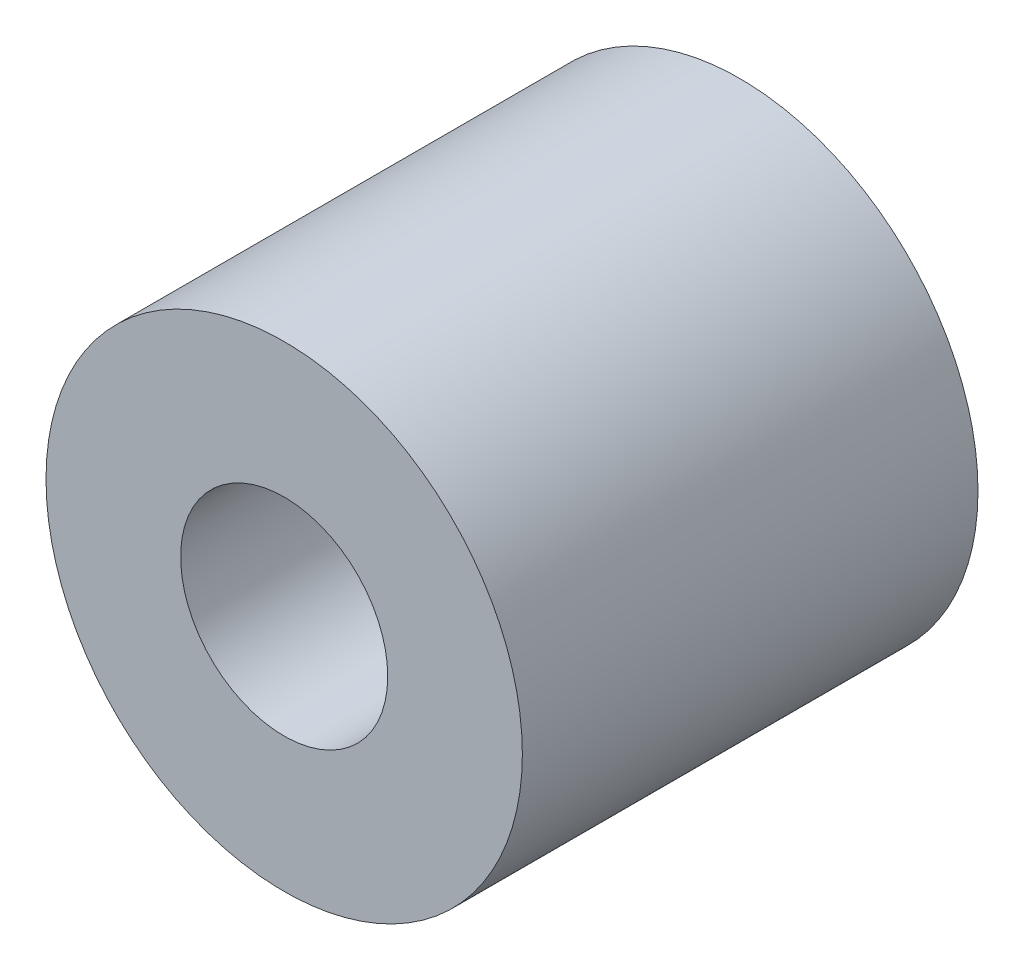
ISO-10303-21;
HEADER;
FILE_DESCRIPTION(('STEP AP214'),'2;1');
FILE_NAME('part.step','',(''),(''),'','','');
FILE_SCHEMA(('AUTOMOTIVE_DESIGN { 1 0 10303 214 1 1 1 1 }'));
ENDSEC;
DATA;
#1=APPLICATION_CONTEXT('core data for automotive mechanical design processes');
#2=APPLICATION_PROTOCOL_DEFINITION('international standard','automotive_design',2000,#1);
#3=PRODUCT_CONTEXT('',#1,'mechanical');
#4=PRODUCT('Part','Part','',(#3));
#5=PRODUCT_RELATED_PRODUCT_CATEGORY('part','',(#4));
#6=PRODUCT_DEFINITION_FORMATION('','',#4);
#7=PRODUCT_DEFINITION_CONTEXT('part definition',#1,'design');
#8=PRODUCT_DEFINITION('design','',#6,#7);
#9=PRODUCT_DEFINITION_SHAPE('','',#8);
#10=(LENGTH_UNIT() NAMED_UNIT(*) SI_UNIT(.MILLI.,.METRE.));
#11=(NAMED_UNIT(*) PLANE_ANGLE_UNIT() SI_UNIT($,.RADIAN.));
#12=(NAMED_UNIT(*) SI_UNIT($,.STERADIAN.) SOLID_ANGLE_UNIT());
#13=UNCERTAINTY_MEASURE_WITH_UNIT(LENGTH_MEASURE(1.E-05),#10,'distance_accuracy_value','');
#14=(GEOMETRIC_REPRESENTATION_CONTEXT(3) GLOBAL_UNCERTAINTY_ASSIGNED_CONTEXT((#13)) GLOBAL_UNIT_ASSIGNED_CONTEXT((#10,
#11,#12)) REPRESENTATION_CONTEXT('',''));
#15=CARTESIAN_POINT('',(0.,0.,0.));
#16=DIRECTION('',(0.,0.,1.));
#17=DIRECTION('',(1.,0.,0.));
#18=AXIS2_PLACEMENT_3D('',#15,#16,#17);
#19=CARTESIAN_POINT('',(0.,0.,22.));
#20=DIRECTION('',(0.,0.,1.));
#21=DIRECTION('',(1.,0.,0.));
#22=AXIS2_PLACEMENT_3D('',#19,#20,#21);
#23=PLANE('',#22);
#24=CARTESIAN_POINT('',(0.,0.,22.));
#25=DIRECTION('',(0.,0.,1.));
#26=DIRECTION('',(1.,0.,0.));
#27=AXIS2_PLACEMENT_3D('',#24,#25,#26);
#28=CIRCLE('',#27,11.5);
#29=CARTESIAN_POINT('',(11.5,0.,22.));
#30=VERTEX_POINT('',#29);
#31=EDGE_CURVE('E12',#30,#30,#28,.T.);
#32=ORIENTED_EDGE('',*,*,#31,.T.);
#33=EDGE_LOOP('',(#32));
#34=FACE_BOUND('',#33,.T.);
#35=CARTESIAN_POINT('',(0.,0.,22.));
#36=DIRECTION('',(0.,0.,1.));
#37=DIRECTION('',(1.,0.,0.));
#38=AXIS2_PLACEMENT_3D('',#35,#36,#37);
#39=CIRCLE('',#38,5.);
#40=CARTESIAN_POINT('',(5.,0.,22.));
#41=VERTEX_POINT('',#40);
#42=EDGE_CURVE('E52',#41,#41,#39,.T.);
#43=ORIENTED_EDGE('',*,*,#42,.F.);
#44=EDGE_LOOP('',(#43));
#45=FACE_BOUND('',#44,.T.);
#46=ADVANCED_FACE('F41',(#34,#45),#23,.T.);
#47=CARTESIAN_POINT('',(0.,0.,0.));
#48=DIRECTION('',(0.,0.,1.));
#49=DIRECTION('',(1.,0.,0.));
#50=AXIS2_PLACEMENT_3D('',#47,#48,#49);
#51=PLANE('',#50);
#52=CARTESIAN_POINT('',(0.,0.,0.));
#53=DIRECTION('',(0.,0.,1.));
#54=DIRECTION('',(1.,0.,0.));
#55=AXIS2_PLACEMENT_3D('',#52,#53,#54);
#56=CIRCLE('',#55,11.5);
#57=CARTESIAN_POINT('',(11.5,0.,0.));
#58=VERTEX_POINT('',#57);
#59=EDGE_CURVE('E45',#58,#58,#56,.T.);
#60=ORIENTED_EDGE('',*,*,#59,.F.);
#61=EDGE_LOOP('',(#60));
#62=FACE_BOUND('',#61,.T.);
#63=CARTESIAN_POINT('',(0.,0.,0.));
#64=DIRECTION('',(0.,0.,1.));
#65=DIRECTION('',(1.,0.,0.));
#66=AXIS2_PLACEMENT_3D('',#63,#64,#65);
#67=CIRCLE('',#66,5.);
#68=CARTESIAN_POINT('',(5.,0.,0.));
#69=VERTEX_POINT('',#68);
#70=EDGE_CURVE('E54',#69,#69,#67,.T.);
#71=ORIENTED_EDGE('',*,*,#70,.T.);
#72=EDGE_LOOP('',(#71));
#73=FACE_BOUND('',#72,.T.);
#74=ADVANCED_FACE('F64',(#62,#73),#51,.F.);
#75=CARTESIAN_POINT('',(0.,0.,22.));
#76=DIRECTION('',(0.,0.,-1.));
#77=DIRECTION('',(-1.,0.,0.));
#78=AXIS2_PLACEMENT_3D('',#75,#76,#77);
#79=CYLINDRICAL_SURFACE('',#78,11.5);
#80=ORIENTED_EDGE('',*,*,#31,.F.);
#81=EDGE_LOOP('',(#80));
#82=FACE_BOUND('',#81,.T.);
#83=ORIENTED_EDGE('',*,*,#59,.T.);
#84=EDGE_LOOP('',(#83));
#85=FACE_BOUND('',#84,.T.);
#86=ADVANCED_FACE('F43',(#82,#85),#79,.T.);
#87=CARTESIAN_POINT('',(0.,0.,22.));
#88=DIRECTION('',(0.,0.,-1.));
#89=DIRECTION('',(-1.,0.,0.));
#90=AXIS2_PLACEMENT_3D('',#87,#88,#89);
#91=CYLINDRICAL_SURFACE('',#90,5.);
#92=ORIENTED_EDGE('',*,*,#42,.T.);
#93=EDGE_LOOP('',(#92));
#94=FACE_BOUND('',#93,.T.);
#95=ORIENTED_EDGE('',*,*,#70,.F.);
#96=EDGE_LOOP('',(#95));
#97=FACE_BOUND('',#96,.T.);
#98=ADVANCED_FACE('F60',(#94,#97),#91,.F.);
#99=CLOSED_SHELL('',(#46,#74,#86,#98));
#100=MANIFOLD_SOLID_BREP('B2',#99);
#101=ADVANCED_BREP_SHAPE_REPRESENTATION('',(#18,#100),#14);
#102=SHAPE_DEFINITION_REPRESENTATION(#9,#101);
ENDSEC;
END-ISO-10303-21;
